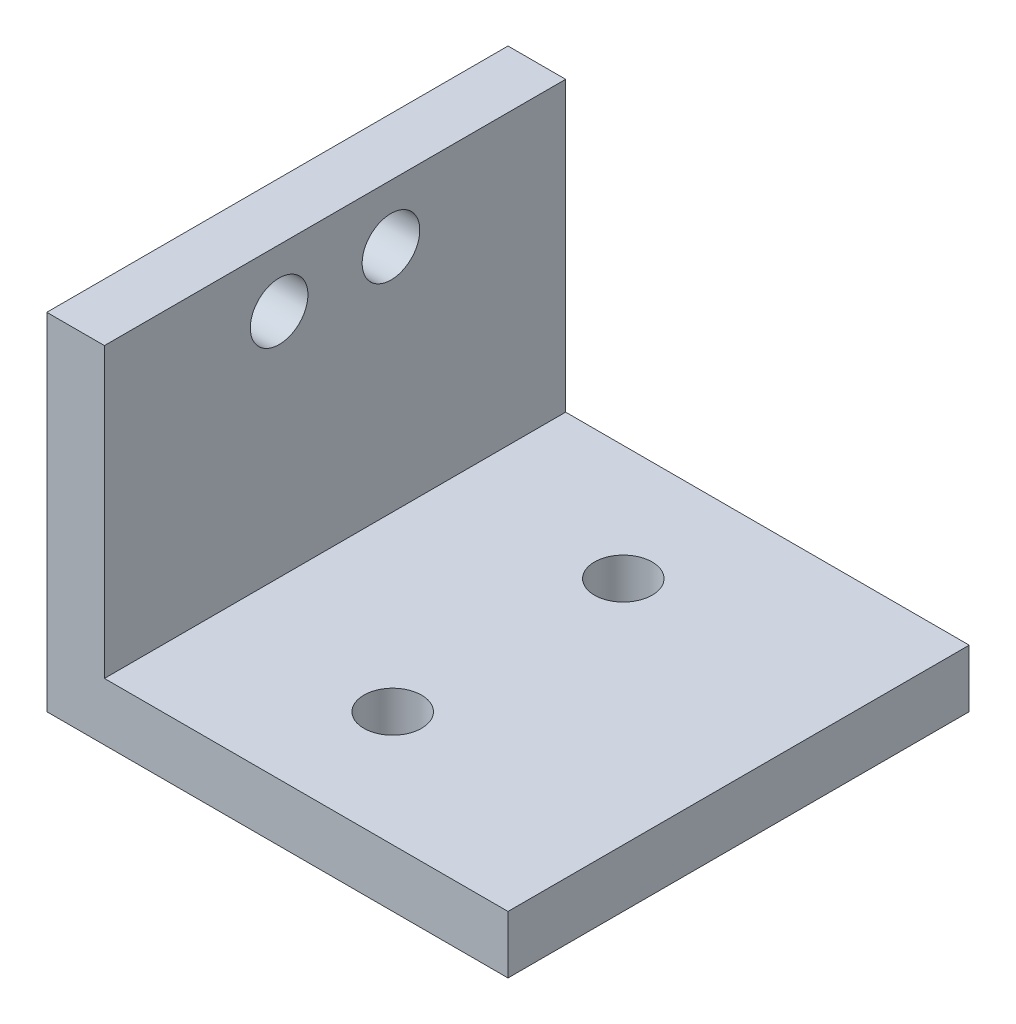
ISO-10303-21;
HEADER;
FILE_DESCRIPTION(('STEP AP214'),'2;1');
FILE_NAME('part.step','',(''),(''),'','','');
FILE_SCHEMA(('AUTOMOTIVE_DESIGN { 1 0 10303 214 1 1 1 1 }'));
ENDSEC;
DATA;
#1=APPLICATION_CONTEXT('core data for automotive mechanical design processes');
#2=APPLICATION_PROTOCOL_DEFINITION('international standard','automotive_design',2000,#1);
#3=PRODUCT_CONTEXT('',#1,'mechanical');
#4=PRODUCT('Part','Part','',(#3));
#5=PRODUCT_RELATED_PRODUCT_CATEGORY('part','',(#4));
#6=PRODUCT_DEFINITION_FORMATION('','',#4);
#7=PRODUCT_DEFINITION_CONTEXT('part definition',#1,'design');
#8=PRODUCT_DEFINITION('design','',#6,#7);
#9=PRODUCT_DEFINITION_SHAPE('','',#8);
#10=(LENGTH_UNIT() NAMED_UNIT(*) SI_UNIT(.MILLI.,.METRE.));
#11=(NAMED_UNIT(*) PLANE_ANGLE_UNIT() SI_UNIT($,.RADIAN.));
#12=(NAMED_UNIT(*) SI_UNIT($,.STERADIAN.) SOLID_ANGLE_UNIT());
#13=UNCERTAINTY_MEASURE_WITH_UNIT(LENGTH_MEASURE(1.E-05),#10,'distance_accuracy_value','');
#14=(GEOMETRIC_REPRESENTATION_CONTEXT(3) GLOBAL_UNCERTAINTY_ASSIGNED_CONTEXT((#13)) GLOBAL_UNIT_ASSIGNED_CONTEXT((#10,
#11,#12)) REPRESENTATION_CONTEXT('',''));
#15=CARTESIAN_POINT('',(0.,0.,0.));
#16=DIRECTION('',(0.,0.,1.));
#17=DIRECTION('',(1.,0.,0.));
#18=AXIS2_PLACEMENT_3D('',#15,#16,#17);
#19=CARTESIAN_POINT('',(0.,0.,40.));
#20=DIRECTION('',(0.,1.,0.));
#21=DIRECTION('',(0.,0.,1.));
#22=AXIS2_PLACEMENT_3D('',#19,#20,#21);
#23=PLANE('',#22);
#24=CARTESIAN_POINT('',(20.,0.,10.));
#25=DIRECTION('',(0.,-1.,0.));
#26=DIRECTION('',(0.,0.,-1.));
#27=AXIS2_PLACEMENT_3D('',#24,#25,#26);
#28=CIRCLE('',#27,2.5);
#29=CARTESIAN_POINT('',(20.,0.,7.5));
#30=VERTEX_POINT('',#29);
#31=EDGE_CURVE('E147',#30,#30,#28,.T.);
#32=ORIENTED_EDGE('',*,*,#31,.F.);
#33=EDGE_LOOP('',(#32));
#34=FACE_BOUND('',#33,.T.);
#35=CARTESIAN_POINT('',(20.,0.,30.));
#36=DIRECTION('',(0.,-1.,0.));
#37=DIRECTION('',(0.,0.,-1.));
#38=AXIS2_PLACEMENT_3D('',#35,#36,#37);
#39=CIRCLE('',#38,2.5);
#40=CARTESIAN_POINT('',(20.,0.,27.5));
#41=VERTEX_POINT('',#40);
#42=EDGE_CURVE('E136',#41,#41,#39,.T.);
#43=ORIENTED_EDGE('',*,*,#42,.F.);
#44=EDGE_LOOP('',(#43));
#45=FACE_BOUND('',#44,.T.);
#46=DIRECTION('',(1.,0.,0.));
#47=VECTOR('',#46,1.);
#48=CARTESIAN_POINT('',(0.,0.,0.));
#49=LINE('',#48,#47);
#50=CARTESIAN_POINT('',(0.,0.,0.));
#51=VERTEX_POINT('',#50);
#52=CARTESIAN_POINT('',(40.,0.,0.));
#53=VERTEX_POINT('',#52);
#54=EDGE_CURVE('E117',#51,#53,#49,.T.);
#55=ORIENTED_EDGE('',*,*,#54,.T.);
#56=DIRECTION('',(0.,0.,-1.));
#57=VECTOR('',#56,1.);
#58=CARTESIAN_POINT('',(40.,0.,40.));
#59=LINE('',#58,#57);
#60=CARTESIAN_POINT('',(40.,0.,40.));
#61=VERTEX_POINT('',#60);
#62=EDGE_CURVE('E11',#61,#53,#59,.T.);
#63=ORIENTED_EDGE('',*,*,#62,.F.);
#64=DIRECTION('',(1.,0.,0.));
#65=VECTOR('',#64,1.);
#66=CARTESIAN_POINT('',(0.,0.,40.));
#67=LINE('',#66,#65);
#68=CARTESIAN_POINT('',(0.,0.,40.));
#69=VERTEX_POINT('',#68);
#70=EDGE_CURVE('E128',#69,#61,#67,.T.);
#71=ORIENTED_EDGE('',*,*,#70,.F.);
#72=DIRECTION('',(0.,0.,-1.));
#73=VECTOR('',#72,1.);
#74=CARTESIAN_POINT('',(0.,0.,40.));
#75=LINE('',#74,#73);
#76=EDGE_CURVE('E113',#69,#51,#75,.T.);
#77=ORIENTED_EDGE('',*,*,#76,.T.);
#78=EDGE_LOOP('',(#55,#63,#71,#77));
#79=FACE_BOUND('',#78,.T.);
#80=ADVANCED_FACE('F31',(#34,#45,#79),#23,.F.);
#81=CARTESIAN_POINT('',(40.,5.,40.));
#82=DIRECTION('',(-1.,0.,0.));
#83=DIRECTION('',(0.,0.,1.));
#84=AXIS2_PLACEMENT_3D('',#81,#82,#83);
#85=PLANE('',#84);
#86=DIRECTION('',(0.,1.,0.));
#87=VECTOR('',#86,1.);
#88=CARTESIAN_POINT('',(40.,5.,0.));
#89=LINE('',#88,#87);
#90=CARTESIAN_POINT('',(40.,5.,0.));
#91=VERTEX_POINT('',#90);
#92=EDGE_CURVE('E120',#53,#91,#89,.T.);
#93=ORIENTED_EDGE('',*,*,#92,.T.);
#94=DIRECTION('',(0.,0.,-1.));
#95=VECTOR('',#94,1.);
#96=CARTESIAN_POINT('',(40.,5.,40.));
#97=LINE('',#96,#95);
#98=CARTESIAN_POINT('',(40.,5.,40.));
#99=VERTEX_POINT('',#98);
#100=EDGE_CURVE('E40',#99,#91,#97,.T.);
#101=ORIENTED_EDGE('',*,*,#100,.F.);
#102=DIRECTION('',(0.,1.,0.));
#103=VECTOR('',#102,1.);
#104=CARTESIAN_POINT('',(40.,5.,40.));
#105=LINE('',#104,#103);
#106=EDGE_CURVE('E86',#61,#99,#105,.T.);
#107=ORIENTED_EDGE('',*,*,#106,.F.);
#108=ORIENTED_EDGE('',*,*,#62,.T.);
#109=EDGE_LOOP('',(#93,#101,#107,#108));
#110=FACE_BOUND('',#109,.T.);
#111=ADVANCED_FACE('F160',(#110),#85,.F.);
#112=CARTESIAN_POINT('',(5.,5.,40.));
#113=DIRECTION('',(0.,-1.,0.));
#114=DIRECTION('',(0.,0.,-1.));
#115=AXIS2_PLACEMENT_3D('',#112,#113,#114);
#116=PLANE('',#115);
#117=CARTESIAN_POINT('',(20.,5.,10.));
#118=DIRECTION('',(0.,-1.,0.));
#119=DIRECTION('',(0.,0.,-1.));
#120=AXIS2_PLACEMENT_3D('',#117,#118,#119);
#121=CIRCLE('',#120,2.5);
#122=CARTESIAN_POINT('',(20.,5.,7.5));
#123=VERTEX_POINT('',#122);
#124=EDGE_CURVE('E34',#123,#123,#121,.T.);
#125=ORIENTED_EDGE('',*,*,#124,.T.);
#126=EDGE_LOOP('',(#125));
#127=FACE_BOUND('',#126,.T.);
#128=CARTESIAN_POINT('',(20.,5.,30.));
#129=DIRECTION('',(0.,-1.,0.));
#130=DIRECTION('',(0.,0.,-1.));
#131=AXIS2_PLACEMENT_3D('',#128,#129,#130);
#132=CIRCLE('',#131,2.5);
#133=CARTESIAN_POINT('',(20.,5.,27.5));
#134=VERTEX_POINT('',#133);
#135=EDGE_CURVE('E133',#134,#134,#132,.T.);
#136=ORIENTED_EDGE('',*,*,#135,.T.);
#137=EDGE_LOOP('',(#136));
#138=FACE_BOUND('',#137,.T.);
#139=DIRECTION('',(-1.,0.,0.));
#140=VECTOR('',#139,1.);
#141=CARTESIAN_POINT('',(5.,5.,0.));
#142=LINE('',#141,#140);
#143=CARTESIAN_POINT('',(5.,5.,0.));
#144=VERTEX_POINT('',#143);
#145=EDGE_CURVE('E123',#91,#144,#142,.T.);
#146=ORIENTED_EDGE('',*,*,#145,.T.);
#147=DIRECTION('',(0.,0.,-1.));
#148=VECTOR('',#147,1.);
#149=CARTESIAN_POINT('',(5.,5.,40.));
#150=LINE('',#149,#148);
#151=CARTESIAN_POINT('',(5.,5.,40.));
#152=VERTEX_POINT('',#151);
#153=EDGE_CURVE('E108',#152,#144,#150,.T.);
#154=ORIENTED_EDGE('',*,*,#153,.F.);
#155=DIRECTION('',(-1.,0.,0.));
#156=VECTOR('',#155,1.);
#157=CARTESIAN_POINT('',(5.,5.,40.));
#158=LINE('',#157,#156);
#159=EDGE_CURVE('E99',#99,#152,#158,.T.);
#160=ORIENTED_EDGE('',*,*,#159,.F.);
#161=ORIENTED_EDGE('',*,*,#100,.T.);
#162=EDGE_LOOP('',(#146,#154,#160,#161));
#163=FACE_BOUND('',#162,.T.);
#164=ADVANCED_FACE('F163',(#127,#138,#163),#116,.F.);
#165=CARTESIAN_POINT('',(5.,5.,40.));
#166=DIRECTION('',(-1.,0.,0.));
#167=DIRECTION('',(0.,0.,1.));
#168=AXIS2_PLACEMENT_3D('',#165,#166,#167);
#169=PLANE('',#168);
#170=CARTESIAN_POINT('',(5.,25.,15.15));
#171=DIRECTION('',(-1.,0.,0.));
#172=DIRECTION('',(0.,0.,1.));
#173=AXIS2_PLACEMENT_3D('',#170,#171,#172);
#174=CIRCLE('',#173,2.5);
#175=CARTESIAN_POINT('',(5.,25.,17.65));
#176=VERTEX_POINT('',#175);
#177=EDGE_CURVE('E140',#176,#176,#174,.T.);
#178=ORIENTED_EDGE('',*,*,#177,.T.);
#179=EDGE_LOOP('',(#178));
#180=FACE_BOUND('',#179,.T.);
#181=CARTESIAN_POINT('',(5.,25.,24.85));
#182=DIRECTION('',(-1.,0.,0.));
#183=DIRECTION('',(0.,0.,1.));
#184=AXIS2_PLACEMENT_3D('',#181,#182,#183);
#185=CIRCLE('',#184,2.5);
#186=CARTESIAN_POINT('',(5.,25.,27.35));
#187=VERTEX_POINT('',#186);
#188=EDGE_CURVE('E121',#187,#187,#185,.T.);
#189=ORIENTED_EDGE('',*,*,#188,.T.);
#190=EDGE_LOOP('',(#189));
#191=FACE_BOUND('',#190,.T.);
#192=DIRECTION('',(0.,1.,0.));
#193=VECTOR('',#192,1.);
#194=CARTESIAN_POINT('',(5.,5.,0.));
#195=LINE('',#194,#193);
#196=CARTESIAN_POINT('',(5.,30.,0.));
#197=VERTEX_POINT('',#196);
#198=EDGE_CURVE('E107',#144,#197,#195,.T.);
#199=ORIENTED_EDGE('',*,*,#198,.T.);
#200=DIRECTION('',(0.,0.,-1.));
#201=VECTOR('',#200,1.);
#202=CARTESIAN_POINT('',(5.,30.,40.));
#203=LINE('',#202,#201);
#204=CARTESIAN_POINT('',(5.,30.,40.));
#205=VERTEX_POINT('',#204);
#206=EDGE_CURVE('E104',#205,#197,#203,.T.);
#207=ORIENTED_EDGE('',*,*,#206,.F.);
#208=DIRECTION('',(0.,1.,0.));
#209=VECTOR('',#208,1.);
#210=CARTESIAN_POINT('',(5.,5.,40.));
#211=LINE('',#210,#209);
#212=EDGE_CURVE('E93',#152,#205,#211,.T.);
#213=ORIENTED_EDGE('',*,*,#212,.F.);
#214=ORIENTED_EDGE('',*,*,#153,.T.);
#215=EDGE_LOOP('',(#199,#207,#213,#214));
#216=FACE_BOUND('',#215,.T.);
#217=ADVANCED_FACE('F105',(#180,#191,#216),#169,.F.);
#218=CARTESIAN_POINT('',(5.,30.,40.));
#219=DIRECTION('',(0.,-1.,0.));
#220=DIRECTION('',(0.,0.,-1.));
#221=AXIS2_PLACEMENT_3D('',#218,#219,#220);
#222=PLANE('',#221);
#223=DIRECTION('',(-1.,0.,0.));
#224=VECTOR('',#223,1.);
#225=CARTESIAN_POINT('',(5.,30.,0.));
#226=LINE('',#225,#224);
#227=CARTESIAN_POINT('',(0.,30.,0.));
#228=VERTEX_POINT('',#227);
#229=EDGE_CURVE('E72',#197,#228,#226,.T.);
#230=ORIENTED_EDGE('',*,*,#229,.T.);
#231=DIRECTION('',(0.,0.,-1.));
#232=VECTOR('',#231,1.);
#233=CARTESIAN_POINT('',(0.,30.,40.));
#234=LINE('',#233,#232);
#235=CARTESIAN_POINT('',(0.,30.,40.));
#236=VERTEX_POINT('',#235);
#237=EDGE_CURVE('E109',#236,#228,#234,.T.);
#238=ORIENTED_EDGE('',*,*,#237,.F.);
#239=DIRECTION('',(-1.,0.,0.));
#240=VECTOR('',#239,1.);
#241=CARTESIAN_POINT('',(5.,30.,40.));
#242=LINE('',#241,#240);
#243=EDGE_CURVE('E97',#205,#236,#242,.T.);
#244=ORIENTED_EDGE('',*,*,#243,.F.);
#245=ORIENTED_EDGE('',*,*,#206,.T.);
#246=EDGE_LOOP('',(#230,#238,#244,#245));
#247=FACE_BOUND('',#246,.T.);
#248=ADVANCED_FACE('F111',(#247),#222,.F.);
#249=CARTESIAN_POINT('',(0.,0.,40.));
#250=DIRECTION('',(1.,0.,0.));
#251=DIRECTION('',(0.,0.,-1.));
#252=AXIS2_PLACEMENT_3D('',#249,#250,#251);
#253=PLANE('',#252);
#254=CARTESIAN_POINT('',(0.,25.,15.15));
#255=DIRECTION('',(-1.,0.,0.));
#256=DIRECTION('',(0.,0.,1.));
#257=AXIS2_PLACEMENT_3D('',#254,#255,#256);
#258=CIRCLE('',#257,2.5);
#259=CARTESIAN_POINT('',(0.,25.,17.65));
#260=VERTEX_POINT('',#259);
#261=EDGE_CURVE('E135',#260,#260,#258,.T.);
#262=ORIENTED_EDGE('',*,*,#261,.F.);
#263=EDGE_LOOP('',(#262));
#264=FACE_BOUND('',#263,.T.);
#265=CARTESIAN_POINT('',(0.,25.,24.85));
#266=DIRECTION('',(-1.,0.,0.));
#267=DIRECTION('',(0.,0.,1.));
#268=AXIS2_PLACEMENT_3D('',#265,#266,#267);
#269=CIRCLE('',#268,2.5);
#270=CARTESIAN_POINT('',(0.,25.,27.35));
#271=VERTEX_POINT('',#270);
#272=EDGE_CURVE('E152',#271,#271,#269,.T.);
#273=ORIENTED_EDGE('',*,*,#272,.F.);
#274=EDGE_LOOP('',(#273));
#275=FACE_BOUND('',#274,.T.);
#276=DIRECTION('',(0.,-1.,0.));
#277=VECTOR('',#276,1.);
#278=CARTESIAN_POINT('',(0.,0.,0.));
#279=LINE('',#278,#277);
#280=EDGE_CURVE('E78',#228,#51,#279,.T.);
#281=ORIENTED_EDGE('',*,*,#280,.T.);
#282=ORIENTED_EDGE('',*,*,#76,.F.);
#283=DIRECTION('',(0.,-1.,0.));
#284=VECTOR('',#283,1.);
#285=CARTESIAN_POINT('',(0.,0.,40.));
#286=LINE('',#285,#284);
#287=EDGE_CURVE('E49',#236,#69,#286,.T.);
#288=ORIENTED_EDGE('',*,*,#287,.F.);
#289=ORIENTED_EDGE('',*,*,#237,.T.);
#290=EDGE_LOOP('',(#281,#282,#288,#289));
#291=FACE_BOUND('',#290,.T.);
#292=ADVANCED_FACE('F168',(#264,#275,#291),#253,.F.);
#293=CARTESIAN_POINT('',(40.,0.,40.));
#294=DIRECTION('',(0.,0.,-1.));
#295=DIRECTION('',(-1.,0.,0.));
#296=AXIS2_PLACEMENT_3D('',#293,#294,#295);
#297=PLANE('',#296);
#298=ORIENTED_EDGE('',*,*,#70,.T.);
#299=ORIENTED_EDGE('',*,*,#106,.T.);
#300=ORIENTED_EDGE('',*,*,#159,.T.);
#301=ORIENTED_EDGE('',*,*,#212,.T.);
#302=ORIENTED_EDGE('',*,*,#243,.T.);
#303=ORIENTED_EDGE('',*,*,#287,.T.);
#304=EDGE_LOOP('',(#298,#299,#300,#301,#302,#303));
#305=FACE_BOUND('',#304,.T.);
#306=ADVANCED_FACE('F95',(#305),#297,.F.);
#307=CARTESIAN_POINT('',(40.,0.,0.));
#308=DIRECTION('',(0.,0.,-1.));
#309=DIRECTION('',(-1.,0.,0.));
#310=AXIS2_PLACEMENT_3D('',#307,#308,#309);
#311=PLANE('',#310);
#312=ORIENTED_EDGE('',*,*,#54,.F.);
#313=ORIENTED_EDGE('',*,*,#280,.F.);
#314=ORIENTED_EDGE('',*,*,#229,.F.);
#315=ORIENTED_EDGE('',*,*,#198,.F.);
#316=ORIENTED_EDGE('',*,*,#145,.F.);
#317=ORIENTED_EDGE('',*,*,#92,.F.);
#318=EDGE_LOOP('',(#312,#313,#314,#315,#316,#317));
#319=FACE_BOUND('',#318,.T.);
#320=ADVANCED_FACE('F166',(#319),#311,.T.);
#321=CARTESIAN_POINT('',(40.,25.,24.85));
#322=DIRECTION('',(-1.,0.,0.));
#323=DIRECTION('',(0.,0.,1.));
#324=AXIS2_PLACEMENT_3D('',#321,#322,#323);
#325=CYLINDRICAL_SURFACE('',#324,2.5);
#326=ORIENTED_EDGE('',*,*,#272,.T.);
#327=EDGE_LOOP('',(#326));
#328=FACE_BOUND('',#327,.T.);
#329=ORIENTED_EDGE('',*,*,#188,.F.);
#330=EDGE_LOOP('',(#329));
#331=FACE_BOUND('',#330,.T.);
#332=ADVANCED_FACE('F210',(#328,#331),#325,.F.);
#333=CARTESIAN_POINT('',(40.,25.,15.15));
#334=DIRECTION('',(-1.,0.,0.));
#335=DIRECTION('',(0.,0.,1.));
#336=AXIS2_PLACEMENT_3D('',#333,#334,#335);
#337=CYLINDRICAL_SURFACE('',#336,2.5);
#338=ORIENTED_EDGE('',*,*,#261,.T.);
#339=EDGE_LOOP('',(#338));
#340=FACE_BOUND('',#339,.T.);
#341=ORIENTED_EDGE('',*,*,#177,.F.);
#342=EDGE_LOOP('',(#341));
#343=FACE_BOUND('',#342,.T.);
#344=ADVANCED_FACE('F212',(#340,#343),#337,.F.);
#345=CARTESIAN_POINT('',(20.,40.,30.));
#346=DIRECTION('',(0.,-1.,0.));
#347=DIRECTION('',(0.,0.,-1.));
#348=AXIS2_PLACEMENT_3D('',#345,#346,#347);
#349=CYLINDRICAL_SURFACE('',#348,2.5);
#350=ORIENTED_EDGE('',*,*,#42,.T.);
#351=EDGE_LOOP('',(#350));
#352=FACE_BOUND('',#351,.T.);
#353=ORIENTED_EDGE('',*,*,#135,.F.);
#354=EDGE_LOOP('',(#353));
#355=FACE_BOUND('',#354,.T.);
#356=ADVANCED_FACE('F193',(#352,#355),#349,.F.);
#357=CARTESIAN_POINT('',(20.,40.,10.));
#358=DIRECTION('',(0.,-1.,0.));
#359=DIRECTION('',(0.,0.,-1.));
#360=AXIS2_PLACEMENT_3D('',#357,#358,#359);
#361=CYLINDRICAL_SURFACE('',#360,2.5);
#362=ORIENTED_EDGE('',*,*,#31,.T.);
#363=EDGE_LOOP('',(#362));
#364=FACE_BOUND('',#363,.T.);
#365=ORIENTED_EDGE('',*,*,#124,.F.);
#366=EDGE_LOOP('',(#365));
#367=FACE_BOUND('',#366,.T.);
#368=ADVANCED_FACE('F190',(#364,#367),#361,.F.);
#369=CLOSED_SHELL('',(#80,#111,#164,#217,#248,#292,#306,#320,#332,#344,#356,#368));
#370=MANIFOLD_SOLID_BREP('B2',#369);
#371=ADVANCED_BREP_SHAPE_REPRESENTATION('',(#18,#370),#14);
#372=SHAPE_DEFINITION_REPRESENTATION(#9,#371);
ENDSEC;
END-ISO-10303-21;
